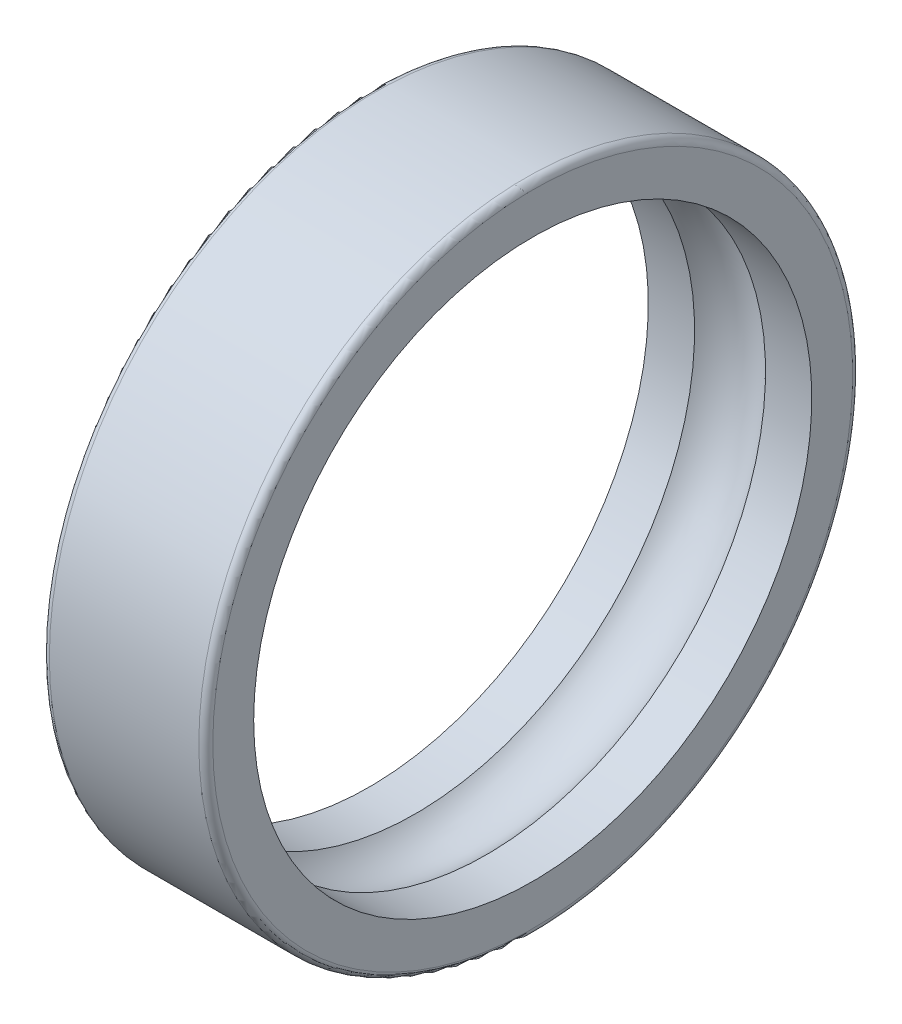
ISO-10303-21;
HEADER;
FILE_DESCRIPTION(('STEP AP214'),'2;1');
FILE_NAME('part.step','',(''),(''),'','','');
FILE_SCHEMA(('AUTOMOTIVE_DESIGN { 1 0 10303 214 1 1 1 1 }'));
ENDSEC;
DATA;
#1=APPLICATION_CONTEXT('core data for automotive mechanical design processes');
#2=APPLICATION_PROTOCOL_DEFINITION('international standard','automotive_design',2000,#1);
#3=PRODUCT_CONTEXT('',#1,'mechanical');
#4=PRODUCT('Part','Part','',(#3));
#5=PRODUCT_RELATED_PRODUCT_CATEGORY('part','',(#4));
#6=PRODUCT_DEFINITION_FORMATION('','',#4);
#7=PRODUCT_DEFINITION_CONTEXT('part definition',#1,'design');
#8=PRODUCT_DEFINITION('design','',#6,#7);
#9=PRODUCT_DEFINITION_SHAPE('','',#8);
#10=(LENGTH_UNIT() NAMED_UNIT(*) SI_UNIT(.MILLI.,.METRE.));
#11=(NAMED_UNIT(*) PLANE_ANGLE_UNIT() SI_UNIT($,.RADIAN.));
#12=(NAMED_UNIT(*) SI_UNIT($,.STERADIAN.) SOLID_ANGLE_UNIT());
#13=UNCERTAINTY_MEASURE_WITH_UNIT(LENGTH_MEASURE(1.E-05),#10,'distance_accuracy_value','');
#14=(GEOMETRIC_REPRESENTATION_CONTEXT(3) GLOBAL_UNCERTAINTY_ASSIGNED_CONTEXT((#13)) GLOBAL_UNIT_ASSIGNED_CONTEXT((#10,
#11,#12)) REPRESENTATION_CONTEXT('',''));
#15=CARTESIAN_POINT('',(0.,0.,0.));
#16=DIRECTION('',(0.,0.,1.));
#17=DIRECTION('',(1.,0.,0.));
#18=AXIS2_PLACEMENT_3D('',#15,#16,#17);
#19=CARTESIAN_POINT('',(0.14999999999997,0.,0.));
#20=DIRECTION('',(-1.,0.,0.));
#21=DIRECTION('',(0.,0.,1.));
#22=AXIS2_PLACEMENT_3D('',#19,#20,#21);
#23=TOROIDAL_SURFACE('',#22,6.85000000000003,0.14999999999997);
#24=CARTESIAN_POINT('',(0.,0.,0.));
#25=DIRECTION('',(-1.,0.,0.));
#26=DIRECTION('',(0.,0.,1.));
#27=AXIS2_PLACEMENT_3D('',#24,#25,#26);
#28=CIRCLE('',#27,6.85);
#29=CARTESIAN_POINT('',(0.,0.,6.85));
#30=VERTEX_POINT('',#29);
#31=EDGE_CURVE('E10',#30,#30,#28,.T.);
#32=ORIENTED_EDGE('',*,*,#31,.F.);
#33=EDGE_LOOP('',(#32));
#34=FACE_BOUND('',#33,.T.);
#35=CARTESIAN_POINT('',(0.15,0.,0.));
#36=DIRECTION('',(-1.,0.,0.));
#37=DIRECTION('',(0.,0.,1.));
#38=AXIS2_PLACEMENT_3D('',#35,#36,#37);
#39=CIRCLE('',#38,7.);
#40=CARTESIAN_POINT('',(0.15,0.,7.));
#41=VERTEX_POINT('',#40);
#42=EDGE_CURVE('E57',#41,#41,#39,.T.);
#43=ORIENTED_EDGE('',*,*,#42,.T.);
#44=EDGE_LOOP('',(#43));
#45=FACE_BOUND('',#44,.T.);
#46=ADVANCED_FACE('F29',(#34,#45),#23,.T.);
#47=CARTESIAN_POINT('',(0.,6.85,0.));
#48=DIRECTION('',(1.,0.,0.));
#49=DIRECTION('',(0.,0.,-1.));
#50=AXIS2_PLACEMENT_3D('',#47,#48,#49);
#51=PLANE('',#50);
#52=CARTESIAN_POINT('',(0.,0.,0.));
#53=DIRECTION('',(-1.,0.,0.));
#54=DIRECTION('',(0.,0.,1.));
#55=AXIS2_PLACEMENT_3D('',#52,#53,#54);
#56=CIRCLE('',#55,5.975);
#57=CARTESIAN_POINT('',(0.,0.,5.975));
#58=VERTEX_POINT('',#57);
#59=EDGE_CURVE('E35',#58,#58,#56,.T.);
#60=ORIENTED_EDGE('',*,*,#59,.F.);
#61=EDGE_LOOP('',(#60));
#62=FACE_BOUND('',#61,.T.);
#63=ORIENTED_EDGE('',*,*,#31,.T.);
#64=EDGE_LOOP('',(#63));
#65=FACE_BOUND('',#64,.T.);
#66=ADVANCED_FACE('F94',(#62,#65),#51,.F.);
#67=CARTESIAN_POINT('',(3.5,0.,0.));
#68=DIRECTION('',(-1.,0.,0.));
#69=DIRECTION('',(0.,0.,1.));
#70=AXIS2_PLACEMENT_3D('',#67,#68,#69);
#71=CYLINDRICAL_SURFACE('',#70,5.975);
#72=CARTESIAN_POINT('',(0.99047712345183,0.,0.));
#73=DIRECTION('',(-1.,0.,0.));
#74=DIRECTION('',(0.,0.,1.));
#75=AXIS2_PLACEMENT_3D('',#72,#73,#74);
#76=CIRCLE('',#75,5.975);
#77=CARTESIAN_POINT('',(0.99047712345183,0.,5.975));
#78=VERTEX_POINT('',#77);
#79=EDGE_CURVE('E39',#78,#78,#76,.T.);
#80=ORIENTED_EDGE('',*,*,#79,.F.);
#81=EDGE_LOOP('',(#80));
#82=FACE_BOUND('',#81,.T.);
#83=ORIENTED_EDGE('',*,*,#59,.T.);
#84=EDGE_LOOP('',(#83));
#85=FACE_BOUND('',#84,.T.);
#86=ADVANCED_FACE('F89',(#82,#85),#71,.F.);
#87=CARTESIAN_POINT('',(1.75000000000002,0.,0.));
#88=DIRECTION('',(-1.,0.,0.));
#89=DIRECTION('',(0.,0.,1.));
#90=AXIS2_PLACEMENT_3D('',#87,#88,#89);
#91=TOROIDAL_SURFACE('',#90,5.24999999999995,1.05000000000005);
#92=CARTESIAN_POINT('',(2.5095228765482,0.,0.));
#93=DIRECTION('',(-1.,0.,0.));
#94=DIRECTION('',(0.,0.,1.));
#95=AXIS2_PLACEMENT_3D('',#92,#93,#94);
#96=CIRCLE('',#95,5.975);
#97=CARTESIAN_POINT('',(2.5095228765482,0.,5.975));
#98=VERTEX_POINT('',#97);
#99=EDGE_CURVE('E43',#98,#98,#96,.T.);
#100=ORIENTED_EDGE('',*,*,#99,.F.);
#101=EDGE_LOOP('',(#100));
#102=FACE_BOUND('',#101,.T.);
#103=ORIENTED_EDGE('',*,*,#79,.T.);
#104=EDGE_LOOP('',(#103));
#105=FACE_BOUND('',#104,.T.);
#106=ADVANCED_FACE('F83',(#102,#105),#91,.F.);
#107=CARTESIAN_POINT('',(3.5,0.,0.));
#108=DIRECTION('',(-1.,0.,0.));
#109=DIRECTION('',(0.,0.,1.));
#110=AXIS2_PLACEMENT_3D('',#107,#108,#109);
#111=CYLINDRICAL_SURFACE('',#110,5.975);
#112=CARTESIAN_POINT('',(3.5,0.,0.));
#113=DIRECTION('',(-1.,0.,0.));
#114=DIRECTION('',(0.,0.,1.));
#115=AXIS2_PLACEMENT_3D('',#112,#113,#114);
#116=CIRCLE('',#115,5.975);
#117=CARTESIAN_POINT('',(3.5,0.,5.975));
#118=VERTEX_POINT('',#117);
#119=EDGE_CURVE('E48',#118,#118,#116,.T.);
#120=ORIENTED_EDGE('',*,*,#119,.F.);
#121=EDGE_LOOP('',(#120));
#122=FACE_BOUND('',#121,.T.);
#123=ORIENTED_EDGE('',*,*,#99,.T.);
#124=EDGE_LOOP('',(#123));
#125=FACE_BOUND('',#124,.T.);
#126=ADVANCED_FACE('F77',(#122,#125),#111,.F.);
#127=CARTESIAN_POINT('',(3.5,5.975,0.));
#128=DIRECTION('',(-1.,0.,0.));
#129=DIRECTION('',(0.,0.,1.));
#130=AXIS2_PLACEMENT_3D('',#127,#128,#129);
#131=PLANE('',#130);
#132=CARTESIAN_POINT('',(3.5,0.,0.));
#133=DIRECTION('',(-1.,0.,0.));
#134=DIRECTION('',(0.,0.,1.));
#135=AXIS2_PLACEMENT_3D('',#132,#133,#134);
#136=CIRCLE('',#135,6.85);
#137=CARTESIAN_POINT('',(3.5,0.,6.85));
#138=VERTEX_POINT('',#137);
#139=EDGE_CURVE('E51',#138,#138,#136,.T.);
#140=ORIENTED_EDGE('',*,*,#139,.F.);
#141=EDGE_LOOP('',(#140));
#142=FACE_BOUND('',#141,.T.);
#143=ORIENTED_EDGE('',*,*,#119,.T.);
#144=EDGE_LOOP('',(#143));
#145=FACE_BOUND('',#144,.T.);
#146=ADVANCED_FACE('F71',(#142,#145),#131,.F.);
#147=CARTESIAN_POINT('',(3.35000000000006,0.,0.));
#148=DIRECTION('',(-1.,0.,0.));
#149=DIRECTION('',(0.,0.,1.));
#150=AXIS2_PLACEMENT_3D('',#147,#148,#149);
#151=TOROIDAL_SURFACE('',#150,6.85000000000006,0.149999999999939);
#152=CARTESIAN_POINT('',(3.35,0.,0.));
#153=DIRECTION('',(-1.,0.,0.));
#154=DIRECTION('',(0.,0.,1.));
#155=AXIS2_PLACEMENT_3D('',#152,#153,#154);
#156=CIRCLE('',#155,7.);
#157=CARTESIAN_POINT('',(3.35,0.,7.));
#158=VERTEX_POINT('',#157);
#159=EDGE_CURVE('E54',#158,#158,#156,.T.);
#160=ORIENTED_EDGE('',*,*,#159,.F.);
#161=EDGE_LOOP('',(#160));
#162=FACE_BOUND('',#161,.T.);
#163=ORIENTED_EDGE('',*,*,#139,.T.);
#164=EDGE_LOOP('',(#163));
#165=FACE_BOUND('',#164,.T.);
#166=ADVANCED_FACE('F65',(#162,#165),#151,.T.);
#167=CARTESIAN_POINT('',(3.5,0.,0.));
#168=DIRECTION('',(-1.,0.,0.));
#169=DIRECTION('',(0.,0.,1.));
#170=AXIS2_PLACEMENT_3D('',#167,#168,#169);
#171=CYLINDRICAL_SURFACE('',#170,7.);
#172=ORIENTED_EDGE('',*,*,#42,.F.);
#173=EDGE_LOOP('',(#172));
#174=FACE_BOUND('',#173,.T.);
#175=ORIENTED_EDGE('',*,*,#159,.T.);
#176=EDGE_LOOP('',(#175));
#177=FACE_BOUND('',#176,.T.);
#178=ADVANCED_FACE('F62',(#174,#177),#171,.T.);
#179=CLOSED_SHELL('',(#46,#66,#86,#106,#126,#146,#166,#178));
#180=MANIFOLD_SOLID_BREP('B2',#179);
#181=ADVANCED_BREP_SHAPE_REPRESENTATION('',(#18,#180),#14);
#182=SHAPE_DEFINITION_REPRESENTATION(#9,#181);
ENDSEC;
END-ISO-10303-21;
